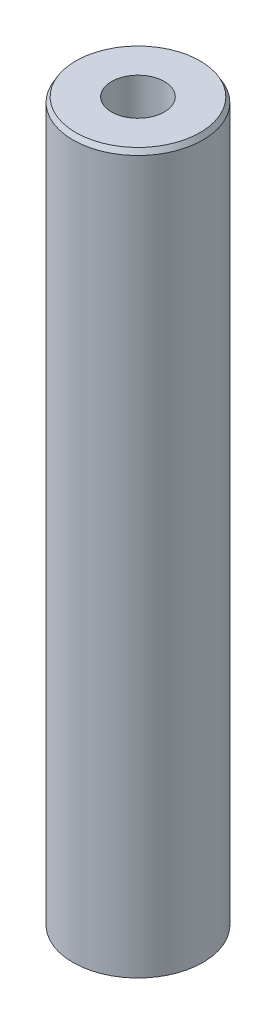
ISO-10303-21;
HEADER;
FILE_DESCRIPTION(('STEP AP214'),'2;1');
FILE_NAME('part.step','',(''),(''),'','','');
FILE_SCHEMA(('AUTOMOTIVE_DESIGN { 1 0 10303 214 1 1 1 1 }'));
ENDSEC;
DATA;
#1=APPLICATION_CONTEXT('core data for automotive mechanical design processes');
#2=APPLICATION_PROTOCOL_DEFINITION('international standard','automotive_design',2000,#1);
#3=PRODUCT_CONTEXT('',#1,'mechanical');
#4=PRODUCT('Part','Part','',(#3));
#5=PRODUCT_RELATED_PRODUCT_CATEGORY('part','',(#4));
#6=PRODUCT_DEFINITION_FORMATION('','',#4);
#7=PRODUCT_DEFINITION_CONTEXT('part definition',#1,'design');
#8=PRODUCT_DEFINITION('design','',#6,#7);
#9=PRODUCT_DEFINITION_SHAPE('','',#8);
#10=(LENGTH_UNIT() NAMED_UNIT(*) SI_UNIT(.MILLI.,.METRE.));
#11=(NAMED_UNIT(*) PLANE_ANGLE_UNIT() SI_UNIT($,.RADIAN.));
#12=(NAMED_UNIT(*) SI_UNIT($,.STERADIAN.) SOLID_ANGLE_UNIT());
#13=UNCERTAINTY_MEASURE_WITH_UNIT(LENGTH_MEASURE(1.E-05),#10,'distance_accuracy_value','');
#14=(GEOMETRIC_REPRESENTATION_CONTEXT(3) GLOBAL_UNCERTAINTY_ASSIGNED_CONTEXT((#13)) GLOBAL_UNIT_ASSIGNED_CONTEXT((#10,
#11,#12)) REPRESENTATION_CONTEXT('',''));
#15=CARTESIAN_POINT('',(0.,0.,0.));
#16=DIRECTION('',(0.,0.,1.));
#17=DIRECTION('',(1.,0.,0.));
#18=AXIS2_PLACEMENT_3D('',#15,#16,#17);
#19=CARTESIAN_POINT('',(0.,110.780177898374,0.));
#20=DIRECTION('',(0.,-1.,0.));
#21=DIRECTION('',(0.,0.,-1.));
#22=AXIS2_PLACEMENT_3D('',#19,#20,#21);
#23=CYLINDRICAL_SURFACE('',#22,10.);
#24=CARTESIAN_POINT('',(0.,110.016001152332,0.));
#25=DIRECTION('',(0.,1.,0.));
#26=DIRECTION('',(0.,0.,1.));
#27=AXIS2_PLACEMENT_3D('',#24,#25,#26);
#28=CIRCLE('',#27,10.);
#29=CARTESIAN_POINT('',(0.,110.016001152332,10.));
#30=VERTEX_POINT('',#29);
#31=EDGE_CURVE('E50',#30,#30,#28,.F.);
#32=ORIENTED_EDGE('',*,*,#31,.T.);
#33=EDGE_LOOP('',(#32));
#34=FACE_BOUND('',#33,.T.);
#35=CARTESIAN_POINT('',(0.,0.441197650035585,0.));
#36=DIRECTION('',(0.,1.,0.));
#37=DIRECTION('',(0.,0.,1.));
#38=AXIS2_PLACEMENT_3D('',#35,#36,#37);
#39=CIRCLE('',#38,10.);
#40=CARTESIAN_POINT('',(0.,0.441197650035585,10.));
#41=VERTEX_POINT('',#40);
#42=EDGE_CURVE('E51',#41,#41,#39,.T.);
#43=ORIENTED_EDGE('',*,*,#42,.T.);
#44=EDGE_LOOP('',(#43));
#45=FACE_BOUND('',#44,.T.);
#46=ADVANCED_FACE('F39',(#34,#45),#23,.T.);
#47=CARTESIAN_POINT('',(0.,110.780177898374,0.));
#48=DIRECTION('',(0.,1.,0.));
#49=DIRECTION('',(0.,0.,1.));
#50=AXIS2_PLACEMENT_3D('',#47,#48,#49);
#51=PLANE('',#50);
#52=CARTESIAN_POINT('',(0.,110.780177898374,0.));
#53=DIRECTION('',(0.,1.,0.));
#54=DIRECTION('',(0.,0.,1.));
#55=AXIS2_PLACEMENT_3D('',#52,#53,#54);
#56=CIRCLE('',#55,9.55880234996438);
#57=CARTESIAN_POINT('',(0.,110.780177898374,9.55880234996438));
#58=VERTEX_POINT('',#57);
#59=EDGE_CURVE('E54',#58,#58,#56,.T.);
#60=ORIENTED_EDGE('',*,*,#59,.T.);
#61=EDGE_LOOP('',(#60));
#62=FACE_BOUND('',#61,.T.);
#63=CARTESIAN_POINT('',(0.,110.780177898374,0.));
#64=DIRECTION('',(0.,1.,0.));
#65=DIRECTION('',(0.,0.,1.));
#66=AXIS2_PLACEMENT_3D('',#63,#64,#65);
#67=CIRCLE('',#66,4.06254486765896);
#68=CARTESIAN_POINT('',(0.,110.780177898374,4.06254486765896));
#69=VERTEX_POINT('',#68);
#70=EDGE_CURVE('E58',#69,#69,#67,.T.);
#71=ORIENTED_EDGE('',*,*,#70,.F.);
#72=EDGE_LOOP('',(#71));
#73=FACE_BOUND('',#72,.T.);
#74=ADVANCED_FACE('F69',(#62,#73),#51,.T.);
#75=CARTESIAN_POINT('',(0.,0.,0.));
#76=DIRECTION('',(0.,1.,0.));
#77=DIRECTION('',(0.,0.,1.));
#78=AXIS2_PLACEMENT_3D('',#75,#76,#77);
#79=PLANE('',#78);
#80=CARTESIAN_POINT('',(0.,0.,0.));
#81=DIRECTION('',(0.,1.,0.));
#82=DIRECTION('',(0.,0.,1.));
#83=AXIS2_PLACEMENT_3D('',#80,#81,#82);
#84=CIRCLE('',#83,9.23582325395836);
#85=CARTESIAN_POINT('',(0.,0.,9.23582325395836));
#86=VERTEX_POINT('',#85);
#87=EDGE_CURVE('E10',#86,#86,#84,.F.);
#88=ORIENTED_EDGE('',*,*,#87,.T.);
#89=EDGE_LOOP('',(#88));
#90=FACE_BOUND('',#89,.T.);
#91=CARTESIAN_POINT('',(0.,0.,0.));
#92=DIRECTION('',(0.,1.,0.));
#93=DIRECTION('',(0.,0.,1.));
#94=AXIS2_PLACEMENT_3D('',#91,#92,#93);
#95=CIRCLE('',#94,4.06254486765896);
#96=CARTESIAN_POINT('',(0.,0.,4.06254486765896));
#97=VERTEX_POINT('',#96);
#98=EDGE_CURVE('E63',#97,#97,#95,.T.);
#99=ORIENTED_EDGE('',*,*,#98,.T.);
#100=EDGE_LOOP('',(#99));
#101=FACE_BOUND('',#100,.T.);
#102=ADVANCED_FACE('F75',(#90,#101),#79,.F.);
#103=CARTESIAN_POINT('',(0.,110.780177898374,0.));
#104=DIRECTION('',(0.,-1.,0.));
#105=DIRECTION('',(0.,0.,-1.));
#106=AXIS2_PLACEMENT_3D('',#103,#104,#105);
#107=CYLINDRICAL_SURFACE('',#106,4.06254486765896);
#108=ORIENTED_EDGE('',*,*,#70,.T.);
#109=EDGE_LOOP('',(#108));
#110=FACE_BOUND('',#109,.T.);
#111=ORIENTED_EDGE('',*,*,#98,.F.);
#112=EDGE_LOOP('',(#111));
#113=FACE_BOUND('',#112,.T.);
#114=ADVANCED_FACE('F70',(#110,#113),#107,.F.);
#115=CARTESIAN_POINT('',(0.,110.780177898374,0.));
#116=DIRECTION('',(0.,-1.,0.));
#117=DIRECTION('',(0.,0.,-1.));
#118=AXIS2_PLACEMENT_3D('',#115,#116,#117);
#119=CONICAL_SURFACE('',#118,9.55880234996438,0.523598775598301);
#120=ORIENTED_EDGE('',*,*,#31,.F.);
#121=EDGE_LOOP('',(#120));
#122=FACE_BOUND('',#121,.T.);
#123=ORIENTED_EDGE('',*,*,#59,.F.);
#124=EDGE_LOOP('',(#123));
#125=FACE_BOUND('',#124,.T.);
#126=ADVANCED_FACE('F81',(#122,#125),#119,.T.);
#127=CARTESIAN_POINT('',(0.,0.441197650035585,0.));
#128=DIRECTION('',(0.,1.,0.));
#129=DIRECTION('',(0.,0.,1.));
#130=AXIS2_PLACEMENT_3D('',#127,#128,#129);
#131=CONICAL_SURFACE('',#130,10.,1.04719755119661);
#132=ORIENTED_EDGE('',*,*,#87,.F.);
#133=EDGE_LOOP('',(#132));
#134=FACE_BOUND('',#133,.T.);
#135=ORIENTED_EDGE('',*,*,#42,.F.);
#136=EDGE_LOOP('',(#135));
#137=FACE_BOUND('',#136,.T.);
#138=ADVANCED_FACE('F45',(#134,#137),#131,.T.);
#139=CLOSED_SHELL('',(#46,#74,#102,#114,#126,#138));
#140=MANIFOLD_SOLID_BREP('B2',#139);
#141=ADVANCED_BREP_SHAPE_REPRESENTATION('',(#18,#140),#14);
#142=SHAPE_DEFINITION_REPRESENTATION(#9,#141);
ENDSEC;
END-ISO-10303-21;
